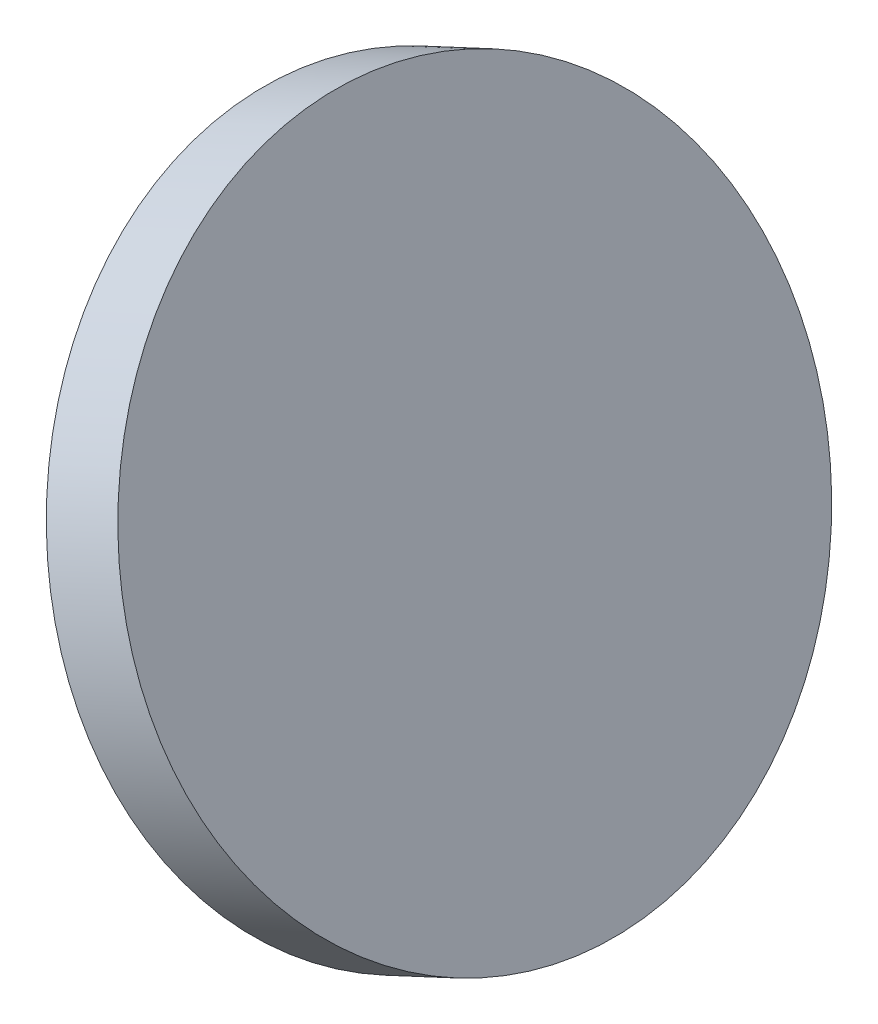
ISO-10303-21;
HEADER;
FILE_DESCRIPTION(('STEP AP214'),'2;1');
FILE_NAME('part.step','',(''),(''),'','','');
FILE_SCHEMA(('AUTOMOTIVE_DESIGN { 1 0 10303 214 1 1 1 1 }'));
ENDSEC;
DATA;
#1=APPLICATION_CONTEXT('core data for automotive mechanical design processes');
#2=APPLICATION_PROTOCOL_DEFINITION('international standard','automotive_design',2000,#1);
#3=PRODUCT_CONTEXT('',#1,'mechanical');
#4=PRODUCT('Part','Part','',(#3));
#5=PRODUCT_RELATED_PRODUCT_CATEGORY('part','',(#4));
#6=PRODUCT_DEFINITION_FORMATION('','',#4);
#7=PRODUCT_DEFINITION_CONTEXT('part definition',#1,'design');
#8=PRODUCT_DEFINITION('design','',#6,#7);
#9=PRODUCT_DEFINITION_SHAPE('','',#8);
#10=(LENGTH_UNIT() NAMED_UNIT(*) SI_UNIT(.MILLI.,.METRE.));
#11=(NAMED_UNIT(*) PLANE_ANGLE_UNIT() SI_UNIT($,.RADIAN.));
#12=(NAMED_UNIT(*) SI_UNIT($,.STERADIAN.) SOLID_ANGLE_UNIT());
#13=UNCERTAINTY_MEASURE_WITH_UNIT(LENGTH_MEASURE(1.E-05),#10,'distance_accuracy_value','');
#14=(GEOMETRIC_REPRESENTATION_CONTEXT(3) GLOBAL_UNCERTAINTY_ASSIGNED_CONTEXT((#13)) GLOBAL_UNIT_ASSIGNED_CONTEXT((#10,
#11,#12)) REPRESENTATION_CONTEXT('',''));
#15=CARTESIAN_POINT('',(0.,0.,0.));
#16=DIRECTION('',(0.,0.,1.));
#17=DIRECTION('',(1.,0.,0.));
#18=AXIS2_PLACEMENT_3D('',#15,#16,#17);
#19=CARTESIAN_POINT('',(147.218923369572,-57.2321452329254,15.85));
#20=DIRECTION('',(-0.906307789857431,-0.422618255691514,0.));
#21=DIRECTION('',(-0.411368767835357,0.882183184877319,0.229191110580954));
#22=AXIS2_PLACEMENT_3D('',#19,#20,#21);
#23=CYLINDRICAL_SURFACE('',#22,12.4999999999977);
#24=CARTESIAN_POINT('',(147.218923369572,-57.2321452329254,15.85));
#25=DIRECTION('',(-0.906307789857431,-0.422618255691514,0.));
#26=DIRECTION('',(0.411368767835357,-0.882183184877319,-0.229191110580954));
#27=AXIS2_PLACEMENT_3D('',#24,#25,#26);
#28=CIRCLE('',#27,12.4999999999977);
#29=CARTESIAN_POINT('',(152.361032967513,-68.2594350438899,12.9851111177386));
#30=VERTEX_POINT('',#29);
#31=EDGE_CURVE('E10',#30,#30,#28,.T.);
#32=ORIENTED_EDGE('',*,*,#31,.T.);
#33=EDGE_LOOP('',(#32));
#34=FACE_BOUND('',#33,.T.);
#35=CARTESIAN_POINT('',(144.5,-58.5,15.85));
#36=DIRECTION('',(-0.906307789857431,-0.422618255691514,0.));
#37=DIRECTION('',(0.411368767835357,-0.882183184877319,-0.229191110580954));
#38=AXIS2_PLACEMENT_3D('',#35,#36,#37);
#39=CIRCLE('',#38,12.4999999999977);
#40=CARTESIAN_POINT('',(149.642109597941,-69.5272898109644,12.9851111177386));
#41=VERTEX_POINT('',#40);
#42=EDGE_CURVE('E18',#41,#41,#39,.T.);
#43=ORIENTED_EDGE('',*,*,#42,.F.);
#44=EDGE_LOOP('',(#43));
#45=FACE_BOUND('',#44,.T.);
#46=ADVANCED_FACE('F15',(#34,#45),#23,.T.);
#47=CARTESIAN_POINT('',(147.218923369572,-57.2321452329254,15.85));
#48=DIRECTION('',(-0.906307789857431,-0.422618255691514,0.));
#49=DIRECTION('',(-0.411368767835357,0.882183184877319,0.229191110580954));
#50=AXIS2_PLACEMENT_3D('',#47,#48,#49);
#51=PLANE('',#50);
#52=ORIENTED_EDGE('',*,*,#31,.F.);
#53=EDGE_LOOP('',(#52));
#54=FACE_BOUND('',#53,.T.);
#55=ADVANCED_FACE('F30',(#54),#51,.F.);
#56=CARTESIAN_POINT('',(144.5,-58.5,15.85));
#57=DIRECTION('',(-0.906307789857431,-0.422618255691514,0.));
#58=DIRECTION('',(-0.411368767835357,0.882183184877319,0.229191110580954));
#59=AXIS2_PLACEMENT_3D('',#56,#57,#58);
#60=PLANE('',#59);
#61=ORIENTED_EDGE('',*,*,#42,.T.);
#62=EDGE_LOOP('',(#61));
#63=FACE_BOUND('',#62,.T.);
#64=ADVANCED_FACE('F27',(#63),#60,.T.);
#65=CLOSED_SHELL('',(#46,#55,#64));
#66=MANIFOLD_SOLID_BREP('B1',#65);
#67=ADVANCED_BREP_SHAPE_REPRESENTATION('',(#18,#66),#14);
#68=SHAPE_DEFINITION_REPRESENTATION(#9,#67);
ENDSEC;
END-ISO-10303-21;
